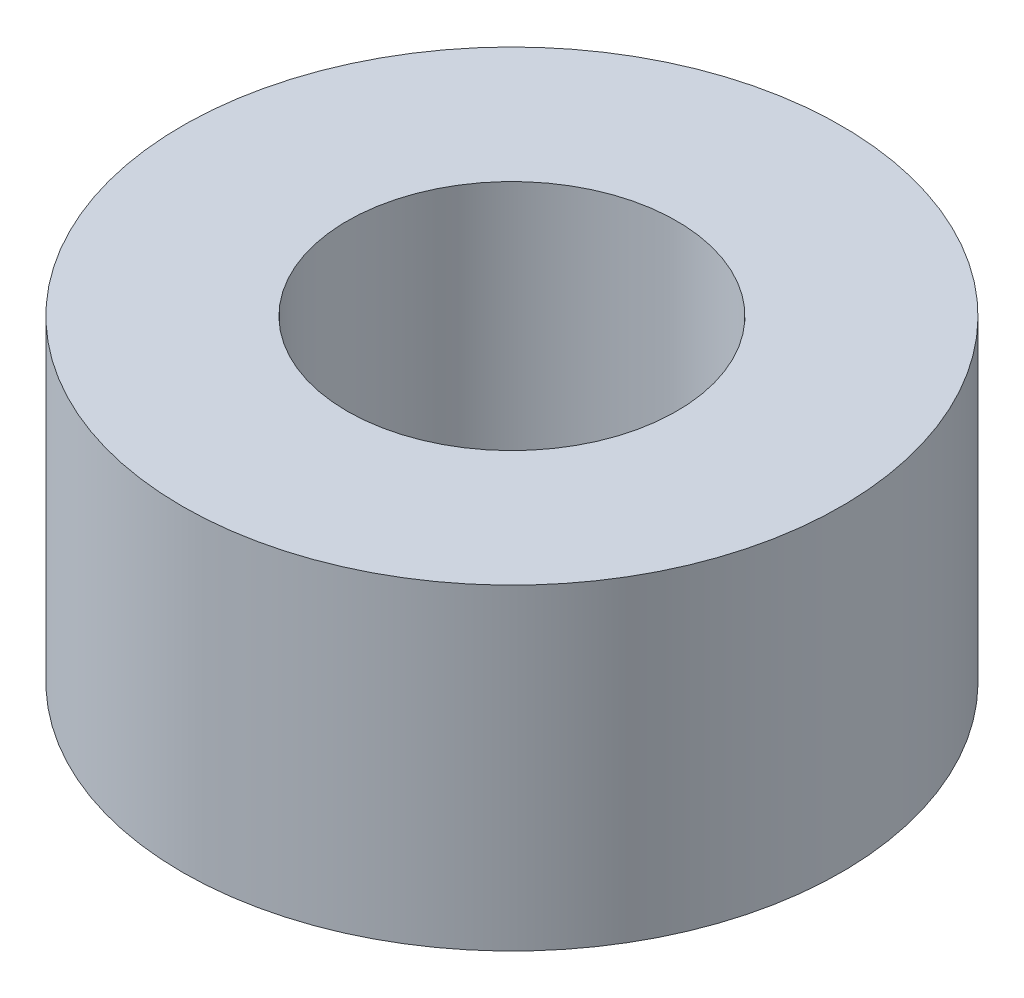
ISO-10303-21;
HEADER;
FILE_DESCRIPTION(('STEP AP214'),'2;1');
FILE_NAME('part.step','',(''),(''),'','','');
FILE_SCHEMA(('AUTOMOTIVE_DESIGN { 1 0 10303 214 1 1 1 1 }'));
ENDSEC;
DATA;
#1=APPLICATION_CONTEXT('core data for automotive mechanical design processes');
#2=APPLICATION_PROTOCOL_DEFINITION('international standard','automotive_design',2000,#1);
#3=PRODUCT_CONTEXT('',#1,'mechanical');
#4=PRODUCT('Part','Part','',(#3));
#5=PRODUCT_RELATED_PRODUCT_CATEGORY('part','',(#4));
#6=PRODUCT_DEFINITION_FORMATION('','',#4);
#7=PRODUCT_DEFINITION_CONTEXT('part definition',#1,'design');
#8=PRODUCT_DEFINITION('design','',#6,#7);
#9=PRODUCT_DEFINITION_SHAPE('','',#8);
#10=(LENGTH_UNIT() NAMED_UNIT(*) SI_UNIT(.MILLI.,.METRE.));
#11=(NAMED_UNIT(*) PLANE_ANGLE_UNIT() SI_UNIT($,.RADIAN.));
#12=(NAMED_UNIT(*) SI_UNIT($,.STERADIAN.) SOLID_ANGLE_UNIT());
#13=UNCERTAINTY_MEASURE_WITH_UNIT(LENGTH_MEASURE(1.E-05),#10,'distance_accuracy_value','');
#14=(GEOMETRIC_REPRESENTATION_CONTEXT(3) GLOBAL_UNCERTAINTY_ASSIGNED_CONTEXT((#13)) GLOBAL_UNIT_ASSIGNED_CONTEXT((#10,
#11,#12)) REPRESENTATION_CONTEXT('',''));
#15=CARTESIAN_POINT('',(0.,0.,0.));
#16=DIRECTION('',(0.,0.,1.));
#17=DIRECTION('',(1.,0.,0.));
#18=AXIS2_PLACEMENT_3D('',#15,#16,#17);
#19=CARTESIAN_POINT('',(0.,3.175,0.));
#20=DIRECTION('',(0.,1.,0.));
#21=DIRECTION('',(0.,0.,1.));
#22=AXIS2_PLACEMENT_3D('',#19,#20,#21);
#23=PLANE('',#22);
#24=CARTESIAN_POINT('',(0.,3.175,0.));
#25=DIRECTION('',(0.,1.,0.));
#26=DIRECTION('',(0.,0.,1.));
#27=AXIS2_PLACEMENT_3D('',#24,#25,#26);
#28=CIRCLE('',#27,3.302);
#29=CARTESIAN_POINT('',(0.,3.175,3.302));
#30=VERTEX_POINT('',#29);
#31=EDGE_CURVE('E10',#30,#30,#28,.T.);
#32=ORIENTED_EDGE('',*,*,#31,.T.);
#33=EDGE_LOOP('',(#32));
#34=FACE_BOUND('',#33,.T.);
#35=CARTESIAN_POINT('',(0.,3.175,0.));
#36=DIRECTION('',(0.,1.,0.));
#37=DIRECTION('',(0.,0.,1.));
#38=AXIS2_PLACEMENT_3D('',#35,#36,#37);
#39=CIRCLE('',#38,1.651);
#40=CARTESIAN_POINT('',(0.,3.175,1.651));
#41=VERTEX_POINT('',#40);
#42=EDGE_CURVE('E54',#41,#41,#39,.T.);
#43=ORIENTED_EDGE('',*,*,#42,.F.);
#44=EDGE_LOOP('',(#43));
#45=FACE_BOUND('',#44,.T.);
#46=ADVANCED_FACE('F43',(#34,#45),#23,.T.);
#47=CARTESIAN_POINT('',(0.,0.,0.));
#48=DIRECTION('',(0.,1.,0.));
#49=DIRECTION('',(0.,0.,1.));
#50=AXIS2_PLACEMENT_3D('',#47,#48,#49);
#51=PLANE('',#50);
#52=CARTESIAN_POINT('',(0.,0.,0.));
#53=DIRECTION('',(0.,1.,0.));
#54=DIRECTION('',(0.,0.,1.));
#55=AXIS2_PLACEMENT_3D('',#52,#53,#54);
#56=CIRCLE('',#55,3.302);
#57=CARTESIAN_POINT('',(0.,0.,3.302));
#58=VERTEX_POINT('',#57);
#59=EDGE_CURVE('E47',#58,#58,#56,.T.);
#60=ORIENTED_EDGE('',*,*,#59,.F.);
#61=EDGE_LOOP('',(#60));
#62=FACE_BOUND('',#61,.T.);
#63=CARTESIAN_POINT('',(0.,0.,0.));
#64=DIRECTION('',(0.,1.,0.));
#65=DIRECTION('',(0.,0.,1.));
#66=AXIS2_PLACEMENT_3D('',#63,#64,#65);
#67=CIRCLE('',#66,1.651);
#68=CARTESIAN_POINT('',(0.,0.,1.651));
#69=VERTEX_POINT('',#68);
#70=EDGE_CURVE('E56',#69,#69,#67,.T.);
#71=ORIENTED_EDGE('',*,*,#70,.T.);
#72=EDGE_LOOP('',(#71));
#73=FACE_BOUND('',#72,.T.);
#74=ADVANCED_FACE('F66',(#62,#73),#51,.F.);
#75=CARTESIAN_POINT('',(0.,3.175,0.));
#76=DIRECTION('',(0.,-1.,0.));
#77=DIRECTION('',(0.,0.,-1.));
#78=AXIS2_PLACEMENT_3D('',#75,#76,#77);
#79=CYLINDRICAL_SURFACE('',#78,3.302);
#80=ORIENTED_EDGE('',*,*,#31,.F.);
#81=EDGE_LOOP('',(#80));
#82=FACE_BOUND('',#81,.T.);
#83=ORIENTED_EDGE('',*,*,#59,.T.);
#84=EDGE_LOOP('',(#83));
#85=FACE_BOUND('',#84,.T.);
#86=ADVANCED_FACE('F45',(#82,#85),#79,.T.);
#87=CARTESIAN_POINT('',(0.,3.175,0.));
#88=DIRECTION('',(0.,-1.,0.));
#89=DIRECTION('',(0.,0.,-1.));
#90=AXIS2_PLACEMENT_3D('',#87,#88,#89);
#91=CYLINDRICAL_SURFACE('',#90,1.651);
#92=ORIENTED_EDGE('',*,*,#42,.T.);
#93=EDGE_LOOP('',(#92));
#94=FACE_BOUND('',#93,.T.);
#95=ORIENTED_EDGE('',*,*,#70,.F.);
#96=EDGE_LOOP('',(#95));
#97=FACE_BOUND('',#96,.T.);
#98=ADVANCED_FACE('F62',(#94,#97),#91,.F.);
#99=CLOSED_SHELL('',(#46,#74,#86,#98));
#100=MANIFOLD_SOLID_BREP('B2',#99);
#101=ADVANCED_BREP_SHAPE_REPRESENTATION('',(#18,#100),#14);
#102=SHAPE_DEFINITION_REPRESENTATION(#9,#101);
ENDSEC;
END-ISO-10303-21;
